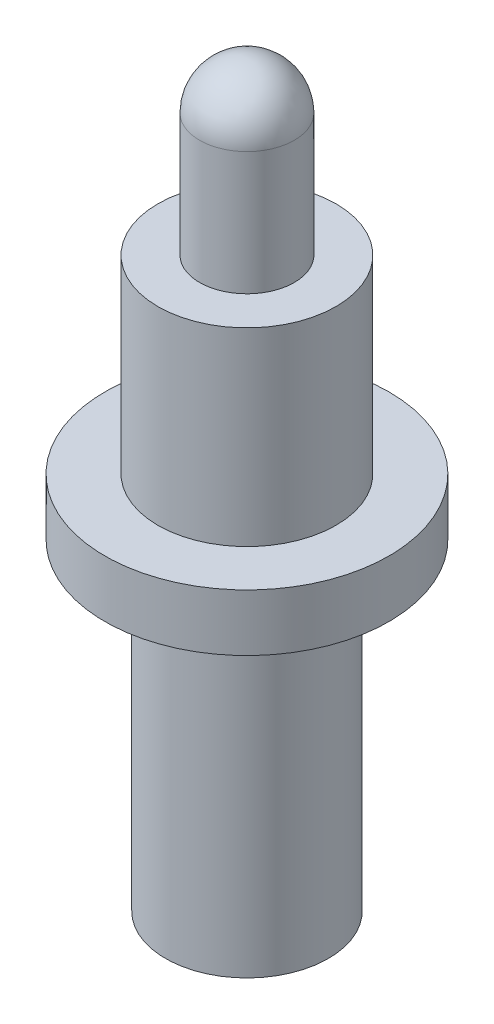
ISO-10303-21;
HEADER;
FILE_DESCRIPTION(('STEP AP214'),'2;1');
FILE_NAME('part.step','',(''),(''),'','','');
FILE_SCHEMA(('AUTOMOTIVE_DESIGN { 1 0 10303 214 1 1 1 1 }'));
ENDSEC;
DATA;
#1=APPLICATION_CONTEXT('core data for automotive mechanical design processes');
#2=APPLICATION_PROTOCOL_DEFINITION('international standard','automotive_design',2000,#1);
#3=PRODUCT_CONTEXT('',#1,'mechanical');
#4=PRODUCT('Part','Part','',(#3));
#5=PRODUCT_RELATED_PRODUCT_CATEGORY('part','',(#4));
#6=PRODUCT_DEFINITION_FORMATION('','',#4);
#7=PRODUCT_DEFINITION_CONTEXT('part definition',#1,'design');
#8=PRODUCT_DEFINITION('design','',#6,#7);
#9=PRODUCT_DEFINITION_SHAPE('','',#8);
#10=(LENGTH_UNIT() NAMED_UNIT(*) SI_UNIT(.MILLI.,.METRE.));
#11=(NAMED_UNIT(*) PLANE_ANGLE_UNIT() SI_UNIT($,.RADIAN.));
#12=(NAMED_UNIT(*) SI_UNIT($,.STERADIAN.) SOLID_ANGLE_UNIT());
#13=UNCERTAINTY_MEASURE_WITH_UNIT(LENGTH_MEASURE(1.E-05),#10,'distance_accuracy_value','');
#14=(GEOMETRIC_REPRESENTATION_CONTEXT(3) GLOBAL_UNCERTAINTY_ASSIGNED_CONTEXT((#13)) GLOBAL_UNIT_ASSIGNED_CONTEXT((#10,
#11,#12)) REPRESENTATION_CONTEXT('',''));
#15=CARTESIAN_POINT('',(0.,0.,0.));
#16=DIRECTION('',(0.,0.,1.));
#17=DIRECTION('',(1.,0.,0.));
#18=AXIS2_PLACEMENT_3D('',#15,#16,#17);
#19=CARTESIAN_POINT('',(0.,0.,-1.0922));
#20=DIRECTION('',(0.,-1.,0.));
#21=DIRECTION('',(0.,0.,-1.));
#22=AXIS2_PLACEMENT_3D('',#19,#20,#21);
#23=PLANE('',#22);
#24=CARTESIAN_POINT('',(0.,0.,0.));
#25=DIRECTION('',(0.,-1.,0.));
#26=DIRECTION('',(0.,0.,-1.));
#27=AXIS2_PLACEMENT_3D('',#24,#25,#26);
#28=CIRCLE('',#27,1.0922);
#29=CARTESIAN_POINT('',(0.,0.,-1.09220000000002));
#30=VERTEX_POINT('',#29);
#31=EDGE_CURVE('E10',#30,#30,#28,.T.);
#32=ORIENTED_EDGE('',*,*,#31,.T.);
#33=EDGE_LOOP('',(#32));
#34=FACE_BOUND('',#33,.T.);
#35=ADVANCED_FACE('F32',(#34),#23,.T.);
#36=CARTESIAN_POINT('',(0.,0.,0.));
#37=DIRECTION('',(0.,-1.,0.));
#38=DIRECTION('',(0.,0.,-1.));
#39=AXIS2_PLACEMENT_3D('',#36,#37,#38);
#40=CYLINDRICAL_SURFACE('',#39,1.0922);
#41=CARTESIAN_POINT('',(0.,4.31799999999999,0.));
#42=DIRECTION('',(0.,-1.,0.));
#43=DIRECTION('',(0.,0.,-1.));
#44=AXIS2_PLACEMENT_3D('',#41,#42,#43);
#45=CIRCLE('',#44,1.0922);
#46=CARTESIAN_POINT('',(0.,4.31799999999999,-1.09220000000002));
#47=VERTEX_POINT('',#46);
#48=EDGE_CURVE('E38',#47,#47,#45,.T.);
#49=ORIENTED_EDGE('',*,*,#48,.T.);
#50=EDGE_LOOP('',(#49));
#51=FACE_BOUND('',#50,.T.);
#52=ORIENTED_EDGE('',*,*,#31,.F.);
#53=EDGE_LOOP('',(#52));
#54=FACE_BOUND('',#53,.T.);
#55=ADVANCED_FACE('F76',(#51,#54),#40,.T.);
#56=CARTESIAN_POINT('',(0.,4.31799999999999,-1.905));
#57=DIRECTION('',(0.,-1.,0.));
#58=DIRECTION('',(0.,0.,-1.));
#59=AXIS2_PLACEMENT_3D('',#56,#57,#58);
#60=PLANE('',#59);
#61=CARTESIAN_POINT('',(0.,4.31799999999999,0.));
#62=DIRECTION('',(0.,-1.,0.));
#63=DIRECTION('',(0.,0.,-1.));
#64=AXIS2_PLACEMENT_3D('',#61,#62,#63);
#65=CIRCLE('',#64,1.905);
#66=CARTESIAN_POINT('',(0.,4.31799999999999,-1.90500000000002));
#67=VERTEX_POINT('',#66);
#68=EDGE_CURVE('E42',#67,#67,#65,.T.);
#69=ORIENTED_EDGE('',*,*,#68,.T.);
#70=EDGE_LOOP('',(#69));
#71=FACE_BOUND('',#70,.T.);
#72=ORIENTED_EDGE('',*,*,#48,.F.);
#73=EDGE_LOOP('',(#72));
#74=FACE_BOUND('',#73,.T.);
#75=ADVANCED_FACE('F80',(#71,#74),#60,.T.);
#76=CARTESIAN_POINT('',(0.,0.,0.));
#77=DIRECTION('',(0.,-1.,0.));
#78=DIRECTION('',(0.,0.,-1.));
#79=AXIS2_PLACEMENT_3D('',#76,#77,#78);
#80=CYLINDRICAL_SURFACE('',#79,1.905);
#81=CARTESIAN_POINT('',(0.,5.07999999999997,0.));
#82=DIRECTION('',(0.,-1.,0.));
#83=DIRECTION('',(0.,0.,-1.));
#84=AXIS2_PLACEMENT_3D('',#81,#82,#83);
#85=CIRCLE('',#84,1.905);
#86=CARTESIAN_POINT('',(0.,5.07999999999997,-1.905));
#87=VERTEX_POINT('',#86);
#88=EDGE_CURVE('E46',#87,#87,#85,.T.);
#89=ORIENTED_EDGE('',*,*,#88,.T.);
#90=EDGE_LOOP('',(#89));
#91=FACE_BOUND('',#90,.T.);
#92=ORIENTED_EDGE('',*,*,#68,.F.);
#93=EDGE_LOOP('',(#92));
#94=FACE_BOUND('',#93,.T.);
#95=ADVANCED_FACE('F84',(#91,#94),#80,.T.);
#96=CARTESIAN_POINT('',(0.,5.08000000000003,-1.19380000000001));
#97=DIRECTION('',(0.,1.,0.));
#98=DIRECTION('',(0.,0.,1.));
#99=AXIS2_PLACEMENT_3D('',#96,#97,#98);
#100=PLANE('',#99);
#101=CARTESIAN_POINT('',(0.,5.07999999999997,0.));
#102=DIRECTION('',(0.,-1.,0.));
#103=DIRECTION('',(0.,0.,-1.));
#104=AXIS2_PLACEMENT_3D('',#101,#102,#103);
#105=CIRCLE('',#104,1.19380000000001);
#106=CARTESIAN_POINT('',(0.,5.07999999999997,-1.1938));
#107=VERTEX_POINT('',#106);
#108=EDGE_CURVE('E51',#107,#107,#105,.T.);
#109=ORIENTED_EDGE('',*,*,#108,.T.);
#110=EDGE_LOOP('',(#109));
#111=FACE_BOUND('',#110,.T.);
#112=ORIENTED_EDGE('',*,*,#88,.F.);
#113=EDGE_LOOP('',(#112));
#114=FACE_BOUND('',#113,.T.);
#115=ADVANCED_FACE('F91',(#111,#114),#100,.T.);
#116=CARTESIAN_POINT('',(0.,0.,0.));
#117=DIRECTION('',(0.,-1.,0.));
#118=DIRECTION('',(0.,0.,-1.));
#119=AXIS2_PLACEMENT_3D('',#116,#117,#118);
#120=CYLINDRICAL_SURFACE('',#119,1.1938);
#121=CARTESIAN_POINT('',(0.,7.61999999999996,0.));
#122=DIRECTION('',(0.,-1.,0.));
#123=DIRECTION('',(0.,0.,-1.));
#124=AXIS2_PLACEMENT_3D('',#121,#122,#123);
#125=CIRCLE('',#124,1.1938);
#126=CARTESIAN_POINT('',(0.,7.61999999999996,-1.1938));
#127=VERTEX_POINT('',#126);
#128=EDGE_CURVE('E54',#127,#127,#125,.T.);
#129=ORIENTED_EDGE('',*,*,#128,.T.);
#130=EDGE_LOOP('',(#129));
#131=FACE_BOUND('',#130,.T.);
#132=ORIENTED_EDGE('',*,*,#108,.F.);
#133=EDGE_LOOP('',(#132));
#134=FACE_BOUND('',#133,.T.);
#135=ADVANCED_FACE('F95',(#131,#134),#120,.T.);
#136=CARTESIAN_POINT('',(0.,7.62000000000002,-0.635000000000011));
#137=DIRECTION('',(0.,1.,0.));
#138=DIRECTION('',(0.,0.,1.));
#139=AXIS2_PLACEMENT_3D('',#136,#137,#138);
#140=PLANE('',#139);
#141=CARTESIAN_POINT('',(0.,7.61999999999996,0.));
#142=DIRECTION('',(0.,-1.,0.));
#143=DIRECTION('',(0.,0.,-1.));
#144=AXIS2_PLACEMENT_3D('',#141,#142,#143);
#145=CIRCLE('',#144,0.635);
#146=CARTESIAN_POINT('',(0.,7.61999999999996,-0.635));
#147=VERTEX_POINT('',#146);
#148=EDGE_CURVE('E57',#147,#147,#145,.T.);
#149=ORIENTED_EDGE('',*,*,#148,.T.);
#150=EDGE_LOOP('',(#149));
#151=FACE_BOUND('',#150,.T.);
#152=ORIENTED_EDGE('',*,*,#128,.F.);
#153=EDGE_LOOP('',(#152));
#154=FACE_BOUND('',#153,.T.);
#155=ADVANCED_FACE('F73',(#151,#154),#140,.T.);
#156=CARTESIAN_POINT('',(0.,0.,0.));
#157=DIRECTION('',(0.,-1.,0.));
#158=DIRECTION('',(0.,0.,-1.));
#159=AXIS2_PLACEMENT_3D('',#156,#157,#158);
#160=CYLINDRICAL_SURFACE('',#159,0.635);
#161=CARTESIAN_POINT('',(0.,9.27100000000003,0.));
#162=DIRECTION('',(0.,-1.,0.));
#163=DIRECTION('',(0.,0.,-1.));
#164=AXIS2_PLACEMENT_3D('',#161,#162,#163);
#165=CIRCLE('',#164,0.635);
#166=CARTESIAN_POINT('',(0.,9.27100000000003,-0.635000000000014));
#167=VERTEX_POINT('',#166);
#168=EDGE_CURVE('E60',#167,#167,#165,.T.);
#169=ORIENTED_EDGE('',*,*,#168,.T.);
#170=EDGE_LOOP('',(#169));
#171=FACE_BOUND('',#170,.T.);
#172=ORIENTED_EDGE('',*,*,#148,.F.);
#173=EDGE_LOOP('',(#172));
#174=FACE_BOUND('',#173,.T.);
#175=ADVANCED_FACE('F64',(#171,#174),#160,.T.);
#176=CARTESIAN_POINT('',(0.,9.27100000000003,0.));
#177=DIRECTION('',(0.,-1.,0.));
#178=DIRECTION('',(0.,0.,-1.));
#179=AXIS2_PLACEMENT_3D('',#176,#177,#178);
#180=SPHERICAL_SURFACE('',#179,0.634999999999999);
#181=ORIENTED_EDGE('',*,*,#168,.F.);
#182=EDGE_LOOP('',(#181));
#183=FACE_BOUND('',#182,.T.);
#184=ADVANCED_FACE('F67',(#183),#180,.T.);
#185=CLOSED_SHELL('',(#35,#55,#75,#95,#115,#135,#155,#175,#184));
#186=MANIFOLD_SOLID_BREP('B2',#185);
#187=ADVANCED_BREP_SHAPE_REPRESENTATION('',(#18,#186),#14);
#188=SHAPE_DEFINITION_REPRESENTATION(#9,#187);
ENDSEC;
END-ISO-10303-21;
